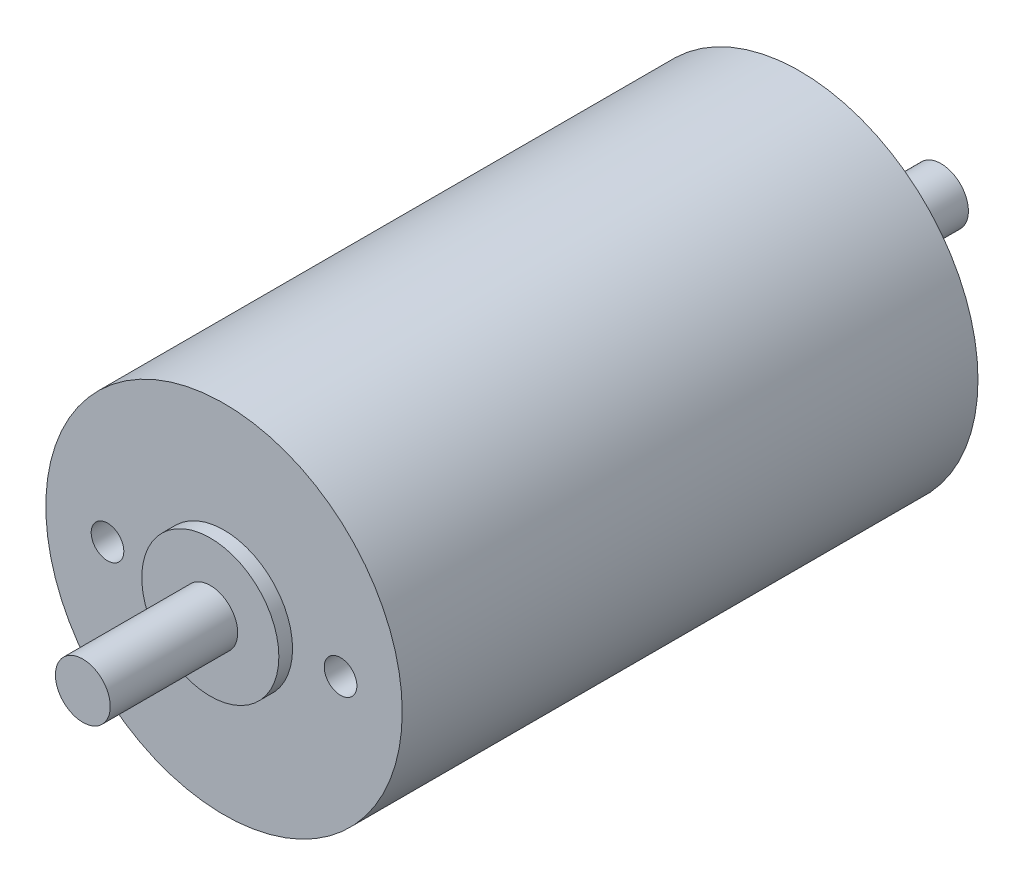
ISO-10303-21;
HEADER;
FILE_DESCRIPTION(('STEP AP214'),'2;1');
FILE_NAME('part.step','',(''),(''),'','','');
FILE_SCHEMA(('AUTOMOTIVE_DESIGN { 1 0 10303 214 1 1 1 1 }'));
ENDSEC;
DATA;
#1=APPLICATION_CONTEXT('core data for automotive mechanical design processes');
#2=APPLICATION_PROTOCOL_DEFINITION('international standard','automotive_design',2000,#1);
#3=PRODUCT_CONTEXT('',#1,'mechanical');
#4=PRODUCT('Part','Part','',(#3));
#5=PRODUCT_RELATED_PRODUCT_CATEGORY('part','',(#4));
#6=PRODUCT_DEFINITION_FORMATION('','',#4);
#7=PRODUCT_DEFINITION_CONTEXT('part definition',#1,'design');
#8=PRODUCT_DEFINITION('design','',#6,#7);
#9=PRODUCT_DEFINITION_SHAPE('','',#8);
#10=(LENGTH_UNIT() NAMED_UNIT(*) SI_UNIT(.MILLI.,.METRE.));
#11=(NAMED_UNIT(*) PLANE_ANGLE_UNIT() SI_UNIT($,.RADIAN.));
#12=(NAMED_UNIT(*) SI_UNIT($,.STERADIAN.) SOLID_ANGLE_UNIT());
#13=UNCERTAINTY_MEASURE_WITH_UNIT(LENGTH_MEASURE(1.E-05),#10,'distance_accuracy_value','');
#14=(GEOMETRIC_REPRESENTATION_CONTEXT(3) GLOBAL_UNCERTAINTY_ASSIGNED_CONTEXT((#13)) GLOBAL_UNIT_ASSIGNED_CONTEXT((#10,
#11,#12)) REPRESENTATION_CONTEXT('',''));
#15=CARTESIAN_POINT('',(0.,0.,0.));
#16=DIRECTION('',(0.,0.,1.));
#17=DIRECTION('',(1.,0.,0.));
#18=AXIS2_PLACEMENT_3D('',#15,#16,#17);
#19=CARTESIAN_POINT('',(0.,0.,21.));
#20=DIRECTION('',(0.,0.,-1.));
#21=DIRECTION('',(-1.,0.,0.));
#22=AXIS2_PLACEMENT_3D('',#19,#20,#21);
#23=CYLINDRICAL_SURFACE('',#22,13.);
#24=CARTESIAN_POINT('',(0.,0.,21.));
#25=DIRECTION('',(0.,0.,1.));
#26=DIRECTION('',(1.,0.,0.));
#27=AXIS2_PLACEMENT_3D('',#24,#25,#26);
#28=CIRCLE('',#27,13.);
#29=CARTESIAN_POINT('',(13.,0.,21.));
#30=VERTEX_POINT('',#29);
#31=EDGE_CURVE('E111',#30,#30,#28,.T.);
#32=ORIENTED_EDGE('',*,*,#31,.F.);
#33=EDGE_LOOP('',(#32));
#34=FACE_BOUND('',#33,.T.);
#35=CARTESIAN_POINT('',(0.,0.,-21.));
#36=DIRECTION('',(0.,0.,1.));
#37=DIRECTION('',(1.,0.,0.));
#38=AXIS2_PLACEMENT_3D('',#35,#36,#37);
#39=CIRCLE('',#38,13.);
#40=CARTESIAN_POINT('',(13.,0.,-21.));
#41=VERTEX_POINT('',#40);
#42=EDGE_CURVE('E47',#41,#41,#39,.T.);
#43=ORIENTED_EDGE('',*,*,#42,.T.);
#44=EDGE_LOOP('',(#43));
#45=FACE_BOUND('',#44,.T.);
#46=ADVANCED_FACE('F44',(#34,#45),#23,.T.);
#47=CARTESIAN_POINT('',(0.,0.,21.));
#48=DIRECTION('',(0.,0.,1.));
#49=DIRECTION('',(1.,0.,0.));
#50=AXIS2_PLACEMENT_3D('',#47,#48,#49);
#51=PLANE('',#50);
#52=CARTESIAN_POINT('',(8.5,0.,21.));
#53=DIRECTION('',(0.,0.,1.));
#54=DIRECTION('',(1.,0.,0.));
#55=AXIS2_PLACEMENT_3D('',#52,#53,#54);
#56=CIRCLE('',#55,1.19062499999999);
#57=CARTESIAN_POINT('',(9.69062499999999,0.,21.));
#58=VERTEX_POINT('',#57);
#59=EDGE_CURVE('E72',#58,#58,#56,.T.);
#60=ORIENTED_EDGE('',*,*,#59,.F.);
#61=EDGE_LOOP('',(#60));
#62=FACE_BOUND('',#61,.T.);
#63=CARTESIAN_POINT('',(-8.5,0.,21.));
#64=DIRECTION('',(0.,0.,1.));
#65=DIRECTION('',(1.,0.,0.));
#66=AXIS2_PLACEMENT_3D('',#63,#64,#65);
#67=CIRCLE('',#66,1.19062499999999);
#68=CARTESIAN_POINT('',(-7.30937500000001,0.,21.));
#69=VERTEX_POINT('',#68);
#70=EDGE_CURVE('E71',#69,#69,#67,.T.);
#71=ORIENTED_EDGE('',*,*,#70,.F.);
#72=EDGE_LOOP('',(#71));
#73=FACE_BOUND('',#72,.T.);
#74=CARTESIAN_POINT('',(0.,0.,21.));
#75=DIRECTION('',(0.,0.,1.));
#76=DIRECTION('',(1.,0.,0.));
#77=AXIS2_PLACEMENT_3D('',#74,#75,#76);
#78=CIRCLE('',#77,5.);
#79=CARTESIAN_POINT('',(5.,0.,21.));
#80=VERTEX_POINT('',#79);
#81=EDGE_CURVE('E105',#80,#80,#78,.T.);
#82=ORIENTED_EDGE('',*,*,#81,.F.);
#83=EDGE_LOOP('',(#82));
#84=FACE_BOUND('',#83,.T.);
#85=ORIENTED_EDGE('',*,*,#31,.T.);
#86=EDGE_LOOP('',(#85));
#87=FACE_BOUND('',#86,.T.);
#88=ADVANCED_FACE('F124',(#62,#73,#84,#87),#51,.T.);
#89=CARTESIAN_POINT('',(0.,0.,-21.));
#90=DIRECTION('',(0.,0.,1.));
#91=DIRECTION('',(1.,0.,0.));
#92=AXIS2_PLACEMENT_3D('',#89,#90,#91);
#93=PLANE('',#92);
#94=CARTESIAN_POINT('',(0.,0.,-21.));
#95=DIRECTION('',(0.,0.,-1.));
#96=DIRECTION('',(-1.,0.,0.));
#97=AXIS2_PLACEMENT_3D('',#94,#95,#96);
#98=CIRCLE('',#97,5.5);
#99=CARTESIAN_POINT('',(-5.5,0.,-21.));
#100=VERTEX_POINT('',#99);
#101=EDGE_CURVE('E97',#100,#100,#98,.T.);
#102=ORIENTED_EDGE('',*,*,#101,.F.);
#103=EDGE_LOOP('',(#102));
#104=FACE_BOUND('',#103,.T.);
#105=ORIENTED_EDGE('',*,*,#42,.F.);
#106=EDGE_LOOP('',(#105));
#107=FACE_BOUND('',#106,.T.);
#108=ADVANCED_FACE('F121',(#104,#107),#93,.F.);
#109=CARTESIAN_POINT('',(0.,0.,22.));
#110=DIRECTION('',(0.,0.,-1.));
#111=DIRECTION('',(-1.,0.,0.));
#112=AXIS2_PLACEMENT_3D('',#109,#110,#111);
#113=CYLINDRICAL_SURFACE('',#112,5.);
#114=CARTESIAN_POINT('',(0.,0.,22.));
#115=DIRECTION('',(0.,0.,1.));
#116=DIRECTION('',(1.,0.,0.));
#117=AXIS2_PLACEMENT_3D('',#114,#115,#116);
#118=CIRCLE('',#117,5.);
#119=CARTESIAN_POINT('',(5.,0.,22.));
#120=VERTEX_POINT('',#119);
#121=EDGE_CURVE('E101',#120,#120,#118,.T.);
#122=ORIENTED_EDGE('',*,*,#121,.F.);
#123=EDGE_LOOP('',(#122));
#124=FACE_BOUND('',#123,.T.);
#125=ORIENTED_EDGE('',*,*,#81,.T.);
#126=EDGE_LOOP('',(#125));
#127=FACE_BOUND('',#126,.T.);
#128=ADVANCED_FACE('F123',(#124,#127),#113,.T.);
#129=CARTESIAN_POINT('',(0.,0.,22.));
#130=DIRECTION('',(0.,0.,1.));
#131=DIRECTION('',(1.,0.,0.));
#132=AXIS2_PLACEMENT_3D('',#129,#130,#131);
#133=PLANE('',#132);
#134=CARTESIAN_POINT('',(0.,0.,22.));
#135=DIRECTION('',(0.,0.,1.));
#136=DIRECTION('',(1.,0.,0.));
#137=AXIS2_PLACEMENT_3D('',#134,#135,#136);
#138=CIRCLE('',#137,2.);
#139=CARTESIAN_POINT('',(2.,0.,22.));
#140=VERTEX_POINT('',#139);
#141=EDGE_CURVE('E53',#140,#140,#138,.T.);
#142=ORIENTED_EDGE('',*,*,#141,.F.);
#143=EDGE_LOOP('',(#142));
#144=FACE_BOUND('',#143,.T.);
#145=ORIENTED_EDGE('',*,*,#121,.T.);
#146=EDGE_LOOP('',(#145));
#147=FACE_BOUND('',#146,.T.);
#148=ADVANCED_FACE('F130',(#144,#147),#133,.T.);
#149=CARTESIAN_POINT('',(0.,0.,-22.));
#150=DIRECTION('',(0.,0.,1.));
#151=DIRECTION('',(1.,0.,0.));
#152=AXIS2_PLACEMENT_3D('',#149,#150,#151);
#153=CYLINDRICAL_SURFACE('',#152,5.5);
#154=CARTESIAN_POINT('',(0.,0.,-22.));
#155=DIRECTION('',(0.,0.,-1.));
#156=DIRECTION('',(-1.,0.,0.));
#157=AXIS2_PLACEMENT_3D('',#154,#155,#156);
#158=CIRCLE('',#157,5.5);
#159=CARTESIAN_POINT('',(-5.5,0.,-22.));
#160=VERTEX_POINT('',#159);
#161=EDGE_CURVE('E93',#160,#160,#158,.T.);
#162=ORIENTED_EDGE('',*,*,#161,.F.);
#163=EDGE_LOOP('',(#162));
#164=FACE_BOUND('',#163,.T.);
#165=ORIENTED_EDGE('',*,*,#101,.T.);
#166=EDGE_LOOP('',(#165));
#167=FACE_BOUND('',#166,.T.);
#168=ADVANCED_FACE('F160',(#164,#167),#153,.T.);
#169=CARTESIAN_POINT('',(0.,0.,-22.));
#170=DIRECTION('',(0.,0.,-1.));
#171=DIRECTION('',(-1.,0.,0.));
#172=AXIS2_PLACEMENT_3D('',#169,#170,#171);
#173=PLANE('',#172);
#174=CARTESIAN_POINT('',(0.,0.,-22.));
#175=DIRECTION('',(0.,0.,-1.));
#176=DIRECTION('',(-1.,0.,0.));
#177=AXIS2_PLACEMENT_3D('',#174,#175,#176);
#178=CIRCLE('',#177,2.);
#179=CARTESIAN_POINT('',(-2.,0.,-22.));
#180=VERTEX_POINT('',#179);
#181=EDGE_CURVE('E11',#180,#180,#178,.T.);
#182=ORIENTED_EDGE('',*,*,#181,.F.);
#183=EDGE_LOOP('',(#182));
#184=FACE_BOUND('',#183,.T.);
#185=ORIENTED_EDGE('',*,*,#161,.T.);
#186=EDGE_LOOP('',(#185));
#187=FACE_BOUND('',#186,.T.);
#188=ADVANCED_FACE('F170',(#184,#187),#173,.T.);
#189=CARTESIAN_POINT('',(0.,0.,31.3));
#190=DIRECTION('',(0.,0.,-1.));
#191=DIRECTION('',(-1.,0.,0.));
#192=AXIS2_PLACEMENT_3D('',#189,#190,#191);
#193=CYLINDRICAL_SURFACE('',#192,2.);
#194=CARTESIAN_POINT('',(0.,0.,31.3));
#195=DIRECTION('',(0.,0.,1.));
#196=DIRECTION('',(1.,0.,0.));
#197=AXIS2_PLACEMENT_3D('',#194,#195,#196);
#198=CIRCLE('',#197,2.);
#199=CARTESIAN_POINT('',(2.,0.,31.3));
#200=VERTEX_POINT('',#199);
#201=EDGE_CURVE('E88',#200,#200,#198,.T.);
#202=ORIENTED_EDGE('',*,*,#201,.F.);
#203=EDGE_LOOP('',(#202));
#204=FACE_BOUND('',#203,.T.);
#205=ORIENTED_EDGE('',*,*,#141,.T.);
#206=EDGE_LOOP('',(#205));
#207=FACE_BOUND('',#206,.T.);
#208=ADVANCED_FACE('F180',(#204,#207),#193,.T.);
#209=CARTESIAN_POINT('',(0.,0.,31.3));
#210=DIRECTION('',(0.,0.,1.));
#211=DIRECTION('',(1.,0.,0.));
#212=AXIS2_PLACEMENT_3D('',#209,#210,#211);
#213=PLANE('',#212);
#214=ORIENTED_EDGE('',*,*,#201,.T.);
#215=EDGE_LOOP('',(#214));
#216=FACE_BOUND('',#215,.T.);
#217=ADVANCED_FACE('F191',(#216),#213,.T.);
#218=CARTESIAN_POINT('',(0.,0.,-31.3));
#219=DIRECTION('',(0.,0.,1.));
#220=DIRECTION('',(1.,0.,0.));
#221=AXIS2_PLACEMENT_3D('',#218,#219,#220);
#222=CYLINDRICAL_SURFACE('',#221,2.);
#223=CARTESIAN_POINT('',(0.,0.,-31.3));
#224=DIRECTION('',(0.,0.,-1.));
#225=DIRECTION('',(-1.,0.,0.));
#226=AXIS2_PLACEMENT_3D('',#223,#224,#225);
#227=CIRCLE('',#226,2.);
#228=CARTESIAN_POINT('',(-2.,0.,-31.3));
#229=VERTEX_POINT('',#228);
#230=EDGE_CURVE('E85',#229,#229,#227,.T.);
#231=ORIENTED_EDGE('',*,*,#230,.F.);
#232=EDGE_LOOP('',(#231));
#233=FACE_BOUND('',#232,.T.);
#234=ORIENTED_EDGE('',*,*,#181,.T.);
#235=EDGE_LOOP('',(#234));
#236=FACE_BOUND('',#235,.T.);
#237=ADVANCED_FACE('F200',(#233,#236),#222,.T.);
#238=CARTESIAN_POINT('',(0.,0.,-31.3));
#239=DIRECTION('',(0.,0.,-1.));
#240=DIRECTION('',(-1.,0.,0.));
#241=AXIS2_PLACEMENT_3D('',#238,#239,#240);
#242=PLANE('',#241);
#243=ORIENTED_EDGE('',*,*,#230,.T.);
#244=EDGE_LOOP('',(#243));
#245=FACE_BOUND('',#244,.T.);
#246=ADVANCED_FACE('F209',(#245),#242,.T.);
#247=CARTESIAN_POINT('',(-8.5,0.,8.3));
#248=DIRECTION('',(0.,0.,1.));
#249=DIRECTION('',(1.,0.,0.));
#250=AXIS2_PLACEMENT_3D('',#247,#248,#249);
#251=CONICAL_SURFACE('',#250,1.19062499999999,1.02974425867665);
#252=CARTESIAN_POINT('',(-8.5,0.,7.58460032547031));
#253=VERTEX_POINT('',#252);
#254=VERTEX_LOOP('',#253);
#255=FACE_BOUND('',#254,.T.);
#256=CARTESIAN_POINT('',(-8.5,0.,8.3));
#257=DIRECTION('',(0.,0.,1.));
#258=DIRECTION('',(1.,0.,0.));
#259=AXIS2_PLACEMENT_3D('',#256,#257,#258);
#260=CIRCLE('',#259,1.19062499999999);
#261=CARTESIAN_POINT('',(-7.30937500000001,0.,8.3));
#262=VERTEX_POINT('',#261);
#263=EDGE_CURVE('E77',#262,#262,#260,.T.);
#264=ORIENTED_EDGE('',*,*,#263,.T.);
#265=EDGE_LOOP('',(#264));
#266=FACE_BOUND('',#265,.T.);
#267=ADVANCED_FACE('F219',(#255,#266),#251,.F.);
#268=CARTESIAN_POINT('',(-8.5,0.,21.));
#269=DIRECTION('',(0.,0.,1.));
#270=DIRECTION('',(1.,0.,0.));
#271=AXIS2_PLACEMENT_3D('',#268,#269,#270);
#272=CYLINDRICAL_SURFACE('',#271,1.19062499999999);
#273=ORIENTED_EDGE('',*,*,#263,.F.);
#274=EDGE_LOOP('',(#273));
#275=FACE_BOUND('',#274,.T.);
#276=ORIENTED_EDGE('',*,*,#70,.T.);
#277=EDGE_LOOP('',(#276));
#278=FACE_BOUND('',#277,.T.);
#279=ADVANCED_FACE('F64',(#275,#278),#272,.F.);
#280=CARTESIAN_POINT('',(8.5,0.,8.3));
#281=DIRECTION('',(0.,0.,1.));
#282=DIRECTION('',(1.,0.,0.));
#283=AXIS2_PLACEMENT_3D('',#280,#281,#282);
#284=CONICAL_SURFACE('',#283,1.19062499999999,1.02974425867665);
#285=CARTESIAN_POINT('',(8.5,0.,7.58460032547031));
#286=VERTEX_POINT('',#285);
#287=VERTEX_LOOP('',#286);
#288=FACE_BOUND('',#287,.T.);
#289=CARTESIAN_POINT('',(8.5,0.,8.3));
#290=DIRECTION('',(0.,0.,1.));
#291=DIRECTION('',(1.,0.,0.));
#292=AXIS2_PLACEMENT_3D('',#289,#290,#291);
#293=CIRCLE('',#292,1.19062499999999);
#294=CARTESIAN_POINT('',(9.69062499999999,0.,8.3));
#295=VERTEX_POINT('',#294);
#296=EDGE_CURVE('E68',#295,#295,#293,.T.);
#297=ORIENTED_EDGE('',*,*,#296,.T.);
#298=EDGE_LOOP('',(#297));
#299=FACE_BOUND('',#298,.T.);
#300=ADVANCED_FACE('F60',(#288,#299),#284,.F.);
#301=CARTESIAN_POINT('',(8.5,0.,21.));
#302=DIRECTION('',(0.,0.,1.));
#303=DIRECTION('',(1.,0.,0.));
#304=AXIS2_PLACEMENT_3D('',#301,#302,#303);
#305=CYLINDRICAL_SURFACE('',#304,1.19062499999999);
#306=ORIENTED_EDGE('',*,*,#296,.F.);
#307=EDGE_LOOP('',(#306));
#308=FACE_BOUND('',#307,.T.);
#309=ORIENTED_EDGE('',*,*,#59,.T.);
#310=EDGE_LOOP('',(#309));
#311=FACE_BOUND('',#310,.T.);
#312=ADVANCED_FACE('F63',(#308,#311),#305,.F.);
#313=CLOSED_SHELL('',(#46,#88,#108,#128,#148,#168,#188,#208,#217,#237,#246,#267,#279,#300,#312));
#314=MANIFOLD_SOLID_BREP('B2',#313);
#315=ADVANCED_BREP_SHAPE_REPRESENTATION('',(#18,#314),#14);
#316=SHAPE_DEFINITION_REPRESENTATION(#9,#315);
ENDSEC;
END-ISO-10303-21;
